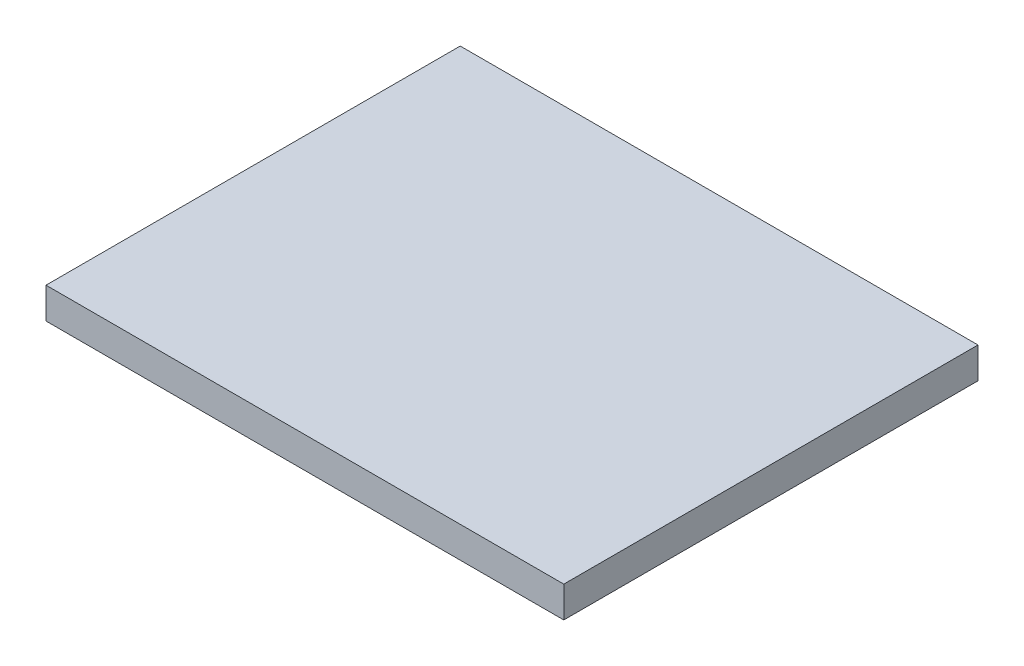
ISO-10303-21;
HEADER;
FILE_DESCRIPTION(('STEP AP214'),'2;1');
FILE_NAME('part.step','',(''),(''),'','','');
FILE_SCHEMA(('AUTOMOTIVE_DESIGN { 1 0 10303 214 1 1 1 1 }'));
ENDSEC;
DATA;
#1=APPLICATION_CONTEXT('core data for automotive mechanical design processes');
#2=APPLICATION_PROTOCOL_DEFINITION('international standard','automotive_design',2000,#1);
#3=PRODUCT_CONTEXT('',#1,'mechanical');
#4=PRODUCT('Part','Part','',(#3));
#5=PRODUCT_RELATED_PRODUCT_CATEGORY('part','',(#4));
#6=PRODUCT_DEFINITION_FORMATION('','',#4);
#7=PRODUCT_DEFINITION_CONTEXT('part definition',#1,'design');
#8=PRODUCT_DEFINITION('design','',#6,#7);
#9=PRODUCT_DEFINITION_SHAPE('','',#8);
#10=(LENGTH_UNIT() NAMED_UNIT(*) SI_UNIT(.MILLI.,.METRE.));
#11=(NAMED_UNIT(*) PLANE_ANGLE_UNIT() SI_UNIT($,.RADIAN.));
#12=(NAMED_UNIT(*) SI_UNIT($,.STERADIAN.) SOLID_ANGLE_UNIT());
#13=UNCERTAINTY_MEASURE_WITH_UNIT(LENGTH_MEASURE(1.E-05),#10,'distance_accuracy_value','');
#14=(GEOMETRIC_REPRESENTATION_CONTEXT(3) GLOBAL_UNCERTAINTY_ASSIGNED_CONTEXT((#13)) GLOBAL_UNIT_ASSIGNED_CONTEXT((#10,
#11,#12)) REPRESENTATION_CONTEXT('',''));
#15=CARTESIAN_POINT('',(0.,0.,0.));
#16=DIRECTION('',(0.,0.,1.));
#17=DIRECTION('',(1.,0.,0.));
#18=AXIS2_PLACEMENT_3D('',#15,#16,#17);
#19=CARTESIAN_POINT('',(-90.8045977011493,6.,-75.5747126436782));
#20=DIRECTION('',(1.,0.,0.));
#21=DIRECTION('',(0.,0.,-1.));
#22=AXIS2_PLACEMENT_3D('',#19,#20,#21);
#23=PLANE('',#22);
#24=DIRECTION('',(0.,0.,1.));
#25=VECTOR('',#24,1.);
#26=CARTESIAN_POINT('',(-90.8045977011493,0.,-75.5747126436782));
#27=LINE('',#26,#25);
#28=CARTESIAN_POINT('',(-90.8045977011493,0.,-75.5747126436782));
#29=VERTEX_POINT('',#28);
#30=CARTESIAN_POINT('',(-90.8045977011493,0.,4.42528735632185));
#31=VERTEX_POINT('',#30);
#32=EDGE_CURVE('E107',#29,#31,#27,.T.);
#33=ORIENTED_EDGE('',*,*,#32,.T.);
#34=DIRECTION('',(0.,-1.,0.));
#35=VECTOR('',#34,1.);
#36=CARTESIAN_POINT('',(-90.8045977011493,6.,4.42528735632185));
#37=LINE('',#36,#35);
#38=CARTESIAN_POINT('',(-90.8045977011493,6.,4.42528735632185));
#39=VERTEX_POINT('',#38);
#40=EDGE_CURVE('E11',#39,#31,#37,.T.);
#41=ORIENTED_EDGE('',*,*,#40,.F.);
#42=DIRECTION('',(0.,0.,1.));
#43=VECTOR('',#42,1.);
#44=CARTESIAN_POINT('',(-90.8045977011493,6.,-75.5747126436782));
#45=LINE('',#44,#43);
#46=CARTESIAN_POINT('',(-90.8045977011493,6.,-75.5747126436782));
#47=VERTEX_POINT('',#46);
#48=EDGE_CURVE('E91',#47,#39,#45,.T.);
#49=ORIENTED_EDGE('',*,*,#48,.F.);
#50=DIRECTION('',(0.,-1.,0.));
#51=VECTOR('',#50,1.);
#52=CARTESIAN_POINT('',(-90.8045977011493,6.,-75.5747126436782));
#53=LINE('',#52,#51);
#54=EDGE_CURVE('E103',#47,#29,#53,.T.);
#55=ORIENTED_EDGE('',*,*,#54,.T.);
#56=EDGE_LOOP('',(#33,#41,#49,#55));
#57=FACE_BOUND('',#56,.T.);
#58=ADVANCED_FACE('F39',(#57),#23,.F.);
#59=CARTESIAN_POINT('',(-90.8045977011493,6.,4.42528735632185));
#60=DIRECTION('',(0.,0.,-1.));
#61=DIRECTION('',(-1.,0.,0.));
#62=AXIS2_PLACEMENT_3D('',#59,#60,#61);
#63=PLANE('',#62);
#64=DIRECTION('',(1.,0.,0.));
#65=VECTOR('',#64,1.);
#66=CARTESIAN_POINT('',(-90.8045977011493,0.,4.42528735632185));
#67=LINE('',#66,#65);
#68=CARTESIAN_POINT('',(9.19540229885073,0.,4.42528735632185));
#69=VERTEX_POINT('',#68);
#70=EDGE_CURVE('E96',#31,#69,#67,.T.);
#71=ORIENTED_EDGE('',*,*,#70,.T.);
#72=DIRECTION('',(0.,-1.,0.));
#73=VECTOR('',#72,1.);
#74=CARTESIAN_POINT('',(9.19540229885073,6.,4.42528735632185));
#75=LINE('',#74,#73);
#76=CARTESIAN_POINT('',(9.19540229885073,6.,4.42528735632185));
#77=VERTEX_POINT('',#76);
#78=EDGE_CURVE('E48',#77,#69,#75,.T.);
#79=ORIENTED_EDGE('',*,*,#78,.F.);
#80=DIRECTION('',(1.,0.,0.));
#81=VECTOR('',#80,1.);
#82=CARTESIAN_POINT('',(-90.8045977011493,6.,4.42528735632185));
#83=LINE('',#82,#81);
#84=EDGE_CURVE('E86',#39,#77,#83,.T.);
#85=ORIENTED_EDGE('',*,*,#84,.F.);
#86=ORIENTED_EDGE('',*,*,#40,.T.);
#87=EDGE_LOOP('',(#71,#79,#85,#86));
#88=FACE_BOUND('',#87,.T.);
#89=ADVANCED_FACE('F95',(#88),#63,.F.);
#90=CARTESIAN_POINT('',(9.19540229885071,6.,-75.5747126436782));
#91=DIRECTION('',(-1.,0.,0.));
#92=DIRECTION('',(0.,0.,1.));
#93=AXIS2_PLACEMENT_3D('',#90,#91,#92);
#94=PLANE('',#93);
#95=DIRECTION('',(0.,0.,-1.));
#96=VECTOR('',#95,1.);
#97=CARTESIAN_POINT('',(9.19540229885071,0.,-75.5747126436782));
#98=LINE('',#97,#96);
#99=CARTESIAN_POINT('',(9.19540229885071,0.,-75.5747126436782));
#100=VERTEX_POINT('',#99);
#101=EDGE_CURVE('E73',#69,#100,#98,.T.);
#102=ORIENTED_EDGE('',*,*,#101,.T.);
#103=DIRECTION('',(0.,-1.,0.));
#104=VECTOR('',#103,1.);
#105=CARTESIAN_POINT('',(9.19540229885071,6.,-75.5747126436782));
#106=LINE('',#105,#104);
#107=CARTESIAN_POINT('',(9.19540229885071,6.,-75.5747126436782));
#108=VERTEX_POINT('',#107);
#109=EDGE_CURVE('E98',#108,#100,#106,.T.);
#110=ORIENTED_EDGE('',*,*,#109,.F.);
#111=DIRECTION('',(0.,0.,-1.));
#112=VECTOR('',#111,1.);
#113=CARTESIAN_POINT('',(9.19540229885071,6.,-75.5747126436782));
#114=LINE('',#113,#112);
#115=EDGE_CURVE('E89',#77,#108,#114,.T.);
#116=ORIENTED_EDGE('',*,*,#115,.F.);
#117=ORIENTED_EDGE('',*,*,#78,.T.);
#118=EDGE_LOOP('',(#102,#110,#116,#117));
#119=FACE_BOUND('',#118,.T.);
#120=ADVANCED_FACE('F99',(#119),#94,.F.);
#121=CARTESIAN_POINT('',(-90.8045977011493,6.,-75.5747126436782));
#122=DIRECTION('',(0.,0.,1.));
#123=DIRECTION('',(1.,0.,0.));
#124=AXIS2_PLACEMENT_3D('',#121,#122,#123);
#125=PLANE('',#124);
#126=DIRECTION('',(-1.,0.,0.));
#127=VECTOR('',#126,1.);
#128=CARTESIAN_POINT('',(-90.8045977011493,0.,-75.5747126436782));
#129=LINE('',#128,#127);
#130=EDGE_CURVE('E79',#100,#29,#129,.T.);
#131=ORIENTED_EDGE('',*,*,#130,.T.);
#132=ORIENTED_EDGE('',*,*,#54,.F.);
#133=DIRECTION('',(-1.,0.,0.));
#134=VECTOR('',#133,1.);
#135=CARTESIAN_POINT('',(-90.8045977011493,6.,-75.5747126436782));
#136=LINE('',#135,#134);
#137=EDGE_CURVE('E56',#108,#47,#136,.T.);
#138=ORIENTED_EDGE('',*,*,#137,.F.);
#139=ORIENTED_EDGE('',*,*,#109,.T.);
#140=EDGE_LOOP('',(#131,#132,#138,#139));
#141=FACE_BOUND('',#140,.T.);
#142=ADVANCED_FACE('F120',(#141),#125,.F.);
#143=CARTESIAN_POINT('',(0.,6.,0.));
#144=DIRECTION('',(0.,1.,0.));
#145=DIRECTION('',(0.,0.,1.));
#146=AXIS2_PLACEMENT_3D('',#143,#144,#145);
#147=PLANE('',#146);
#148=ORIENTED_EDGE('',*,*,#48,.T.);
#149=ORIENTED_EDGE('',*,*,#84,.T.);
#150=ORIENTED_EDGE('',*,*,#115,.T.);
#151=ORIENTED_EDGE('',*,*,#137,.T.);
#152=EDGE_LOOP('',(#148,#149,#150,#151));
#153=FACE_BOUND('',#152,.T.);
#154=ADVANCED_FACE('F87',(#153),#147,.T.);
#155=CARTESIAN_POINT('',(0.,0.,0.));
#156=DIRECTION('',(0.,1.,0.));
#157=DIRECTION('',(0.,0.,1.));
#158=AXIS2_PLACEMENT_3D('',#155,#156,#157);
#159=PLANE('',#158);
#160=ORIENTED_EDGE('',*,*,#32,.F.);
#161=ORIENTED_EDGE('',*,*,#130,.F.);
#162=ORIENTED_EDGE('',*,*,#101,.F.);
#163=ORIENTED_EDGE('',*,*,#70,.F.);
#164=EDGE_LOOP('',(#160,#161,#162,#163));
#165=FACE_BOUND('',#164,.T.);
#166=ADVANCED_FACE('F123',(#165),#159,.F.);
#167=CLOSED_SHELL('',(#58,#89,#120,#142,#154,#166));
#168=MANIFOLD_SOLID_BREP('B2',#167);
#169=ADVANCED_BREP_SHAPE_REPRESENTATION('',(#18,#168),#14);
#170=SHAPE_DEFINITION_REPRESENTATION(#9,#169);
ENDSEC;
END-ISO-10303-21;
